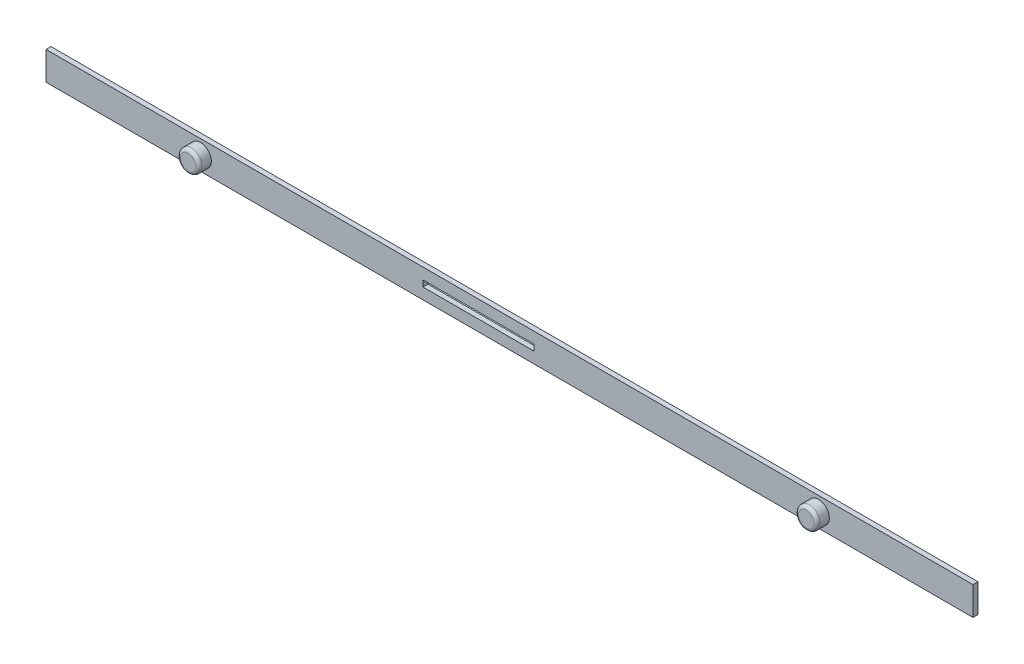
ISO-10303-21;
HEADER;
FILE_DESCRIPTION(('STEP AP214'),'2;1');
FILE_NAME('part.step','',(''),(''),'','','');
FILE_SCHEMA(('AUTOMOTIVE_DESIGN { 1 0 10303 214 1 1 1 1 }'));
ENDSEC;
DATA;
#1=APPLICATION_CONTEXT('core data for automotive mechanical design processes');
#2=APPLICATION_PROTOCOL_DEFINITION('international standard','automotive_design',2000,#1);
#3=PRODUCT_CONTEXT('',#1,'mechanical');
#4=PRODUCT('Part','Part','',(#3));
#5=PRODUCT_RELATED_PRODUCT_CATEGORY('part','',(#4));
#6=PRODUCT_DEFINITION_FORMATION('','',#4);
#7=PRODUCT_DEFINITION_CONTEXT('part definition',#1,'design');
#8=PRODUCT_DEFINITION('design','',#6,#7);
#9=PRODUCT_DEFINITION_SHAPE('','',#8);
#10=(LENGTH_UNIT() NAMED_UNIT(*) SI_UNIT(.MILLI.,.METRE.));
#11=(NAMED_UNIT(*) PLANE_ANGLE_UNIT() SI_UNIT($,.RADIAN.));
#12=(NAMED_UNIT(*) SI_UNIT($,.STERADIAN.) SOLID_ANGLE_UNIT());
#13=UNCERTAINTY_MEASURE_WITH_UNIT(LENGTH_MEASURE(1.E-05),#10,'distance_accuracy_value','');
#14=(GEOMETRIC_REPRESENTATION_CONTEXT(3) GLOBAL_UNCERTAINTY_ASSIGNED_CONTEXT((#13)) GLOBAL_UNIT_ASSIGNED_CONTEXT((#10,
#11,#12)) REPRESENTATION_CONTEXT('',''));
#15=CARTESIAN_POINT('',(0.,0.,0.));
#16=DIRECTION('',(0.,0.,1.));
#17=DIRECTION('',(1.,0.,0.));
#18=AXIS2_PLACEMENT_3D('',#15,#16,#17);
#19=CARTESIAN_POINT('',(0.,0.,0.8));
#20=DIRECTION('',(0.,0.,1.));
#21=DIRECTION('',(1.,0.,0.));
#22=AXIS2_PLACEMENT_3D('',#19,#20,#21);
#23=PLANE('',#22);
#24=CARTESIAN_POINT('',(50.,0.,0.8));
#25=DIRECTION('',(0.,0.,1.));
#26=DIRECTION('',(1.,0.,0.));
#27=AXIS2_PLACEMENT_3D('',#24,#25,#26);
#28=CIRCLE('',#27,1.75);
#29=CARTESIAN_POINT('',(51.75,0.,0.8));
#30=VERTEX_POINT('',#29);
#31=EDGE_CURVE('E328',#30,#30,#28,.T.);
#32=ORIENTED_EDGE('',*,*,#31,.F.);
#33=EDGE_LOOP('',(#32));
#34=FACE_BOUND('',#33,.T.);
#35=CARTESIAN_POINT('',(-50.,0.,0.8));
#36=DIRECTION('',(0.,0.,1.));
#37=DIRECTION('',(1.,0.,0.));
#38=AXIS2_PLACEMENT_3D('',#35,#36,#37);
#39=CIRCLE('',#38,1.75);
#40=CARTESIAN_POINT('',(-48.25,0.,0.8));
#41=VERTEX_POINT('',#40);
#42=EDGE_CURVE('E126',#41,#41,#39,.T.);
#43=ORIENTED_EDGE('',*,*,#42,.F.);
#44=EDGE_LOOP('',(#43));
#45=FACE_BOUND('',#44,.T.);
#46=DIRECTION('',(0.,1.,0.));
#47=VECTOR('',#46,1.);
#48=CARTESIAN_POINT('',(75.,2.3,0.8));
#49=LINE('',#48,#47);
#50=CARTESIAN_POINT('',(75.,-2.3,0.8));
#51=VERTEX_POINT('',#50);
#52=CARTESIAN_POINT('',(75.,2.3,0.8));
#53=VERTEX_POINT('',#52);
#54=EDGE_CURVE('E136',#51,#53,#49,.T.);
#55=ORIENTED_EDGE('',*,*,#54,.T.);
#56=DIRECTION('',(-1.,0.,0.));
#57=VECTOR('',#56,1.);
#58=CARTESIAN_POINT('',(-75.,2.3,0.8));
#59=LINE('',#58,#57);
#60=CARTESIAN_POINT('',(-75.,2.3,0.8));
#61=VERTEX_POINT('',#60);
#62=EDGE_CURVE('E139',#53,#61,#59,.T.);
#63=ORIENTED_EDGE('',*,*,#62,.T.);
#64=DIRECTION('',(0.,-1.,0.));
#65=VECTOR('',#64,1.);
#66=CARTESIAN_POINT('',(-75.,2.3,0.8));
#67=LINE('',#66,#65);
#68=CARTESIAN_POINT('',(-75.,-2.30000000000001,0.8));
#69=VERTEX_POINT('',#68);
#70=EDGE_CURVE('E142',#61,#69,#67,.T.);
#71=ORIENTED_EDGE('',*,*,#70,.T.);
#72=DIRECTION('',(1.,0.,0.));
#73=VECTOR('',#72,1.);
#74=CARTESIAN_POINT('',(-75.,-2.30000000000001,0.8));
#75=LINE('',#74,#73);
#76=EDGE_CURVE('E144',#69,#51,#75,.T.);
#77=ORIENTED_EDGE('',*,*,#76,.T.);
#78=EDGE_LOOP('',(#55,#63,#71,#77));
#79=FACE_BOUND('',#78,.T.);
#80=DIRECTION('',(1.,0.,0.));
#81=VECTOR('',#80,1.);
#82=CARTESIAN_POINT('',(4.,-0.499999999999995,0.8));
#83=LINE('',#82,#81);
#84=CARTESIAN_POINT('',(-14.,-0.499999999999997,0.8));
#85=VERTEX_POINT('',#84);
#86=CARTESIAN_POINT('',(4.,-0.499999999999995,0.8));
#87=VERTEX_POINT('',#86);
#88=EDGE_CURVE('E106',#85,#87,#83,.T.);
#89=ORIENTED_EDGE('',*,*,#88,.F.);
#90=DIRECTION('',(0.,-1.,0.));
#91=VECTOR('',#90,1.);
#92=CARTESIAN_POINT('',(-14.,0.500000000000003,0.8));
#93=LINE('',#92,#91);
#94=CARTESIAN_POINT('',(-14.,0.500000000000003,0.8));
#95=VERTEX_POINT('',#94);
#96=EDGE_CURVE('E98',#95,#85,#93,.T.);
#97=ORIENTED_EDGE('',*,*,#96,.F.);
#98=DIRECTION('',(-1.,0.,0.));
#99=VECTOR('',#98,1.);
#100=CARTESIAN_POINT('',(4.,0.500000000000005,0.8));
#101=LINE('',#100,#99);
#102=CARTESIAN_POINT('',(4.,0.500000000000005,0.8));
#103=VERTEX_POINT('',#102);
#104=EDGE_CURVE('E120',#103,#95,#101,.T.);
#105=ORIENTED_EDGE('',*,*,#104,.F.);
#106=DIRECTION('',(0.,1.,0.));
#107=VECTOR('',#106,1.);
#108=CARTESIAN_POINT('',(4.,0.500000000000005,0.8));
#109=LINE('',#108,#107);
#110=EDGE_CURVE('E118',#87,#103,#109,.T.);
#111=ORIENTED_EDGE('',*,*,#110,.F.);
#112=EDGE_LOOP('',(#89,#97,#105,#111));
#113=FACE_BOUND('',#112,.T.);
#114=ADVANCED_FACE('F33',(#34,#45,#79,#113),#23,.T.);
#115=CARTESIAN_POINT('',(0.,0.,0.));
#116=DIRECTION('',(0.,0.,1.));
#117=DIRECTION('',(1.,0.,0.));
#118=AXIS2_PLACEMENT_3D('',#115,#116,#117);
#119=PLANE('',#118);
#120=DIRECTION('',(0.,1.,0.));
#121=VECTOR('',#120,1.);
#122=CARTESIAN_POINT('',(75.,2.3,0.));
#123=LINE('',#122,#121);
#124=CARTESIAN_POINT('',(75.,-2.3,0.));
#125=VERTEX_POINT('',#124);
#126=CARTESIAN_POINT('',(75.,2.3,0.));
#127=VERTEX_POINT('',#126);
#128=EDGE_CURVE('E114',#125,#127,#123,.T.);
#129=ORIENTED_EDGE('',*,*,#128,.F.);
#130=DIRECTION('',(1.,0.,0.));
#131=VECTOR('',#130,1.);
#132=CARTESIAN_POINT('',(-75.,-2.30000000000001,0.));
#133=LINE('',#132,#131);
#134=CARTESIAN_POINT('',(-75.,-2.30000000000001,0.));
#135=VERTEX_POINT('',#134);
#136=EDGE_CURVE('E140',#135,#125,#133,.T.);
#137=ORIENTED_EDGE('',*,*,#136,.F.);
#138=DIRECTION('',(0.,-1.,0.));
#139=VECTOR('',#138,1.);
#140=CARTESIAN_POINT('',(-75.,2.3,0.));
#141=LINE('',#140,#139);
#142=CARTESIAN_POINT('',(-75.,2.3,0.));
#143=VERTEX_POINT('',#142);
#144=EDGE_CURVE('E151',#143,#135,#141,.T.);
#145=ORIENTED_EDGE('',*,*,#144,.F.);
#146=DIRECTION('',(-1.,0.,0.));
#147=VECTOR('',#146,1.);
#148=CARTESIAN_POINT('',(-75.,2.3,0.));
#149=LINE('',#148,#147);
#150=EDGE_CURVE('E149',#127,#143,#149,.T.);
#151=ORIENTED_EDGE('',*,*,#150,.F.);
#152=EDGE_LOOP('',(#129,#137,#145,#151));
#153=FACE_BOUND('',#152,.T.);
#154=DIRECTION('',(0.,-1.,0.));
#155=VECTOR('',#154,1.);
#156=CARTESIAN_POINT('',(-14.,0.500000000000003,0.));
#157=LINE('',#156,#155);
#158=CARTESIAN_POINT('',(-14.,0.500000000000003,0.));
#159=VERTEX_POINT('',#158);
#160=CARTESIAN_POINT('',(-14.,-0.499999999999997,0.));
#161=VERTEX_POINT('',#160);
#162=EDGE_CURVE('E56',#159,#161,#157,.T.);
#163=ORIENTED_EDGE('',*,*,#162,.T.);
#164=DIRECTION('',(1.,0.,0.));
#165=VECTOR('',#164,1.);
#166=CARTESIAN_POINT('',(4.,-0.499999999999995,0.));
#167=LINE('',#166,#165);
#168=CARTESIAN_POINT('',(4.,-0.499999999999995,0.));
#169=VERTEX_POINT('',#168);
#170=EDGE_CURVE('E113',#161,#169,#167,.T.);
#171=ORIENTED_EDGE('',*,*,#170,.T.);
#172=DIRECTION('',(0.,1.,0.));
#173=VECTOR('',#172,1.);
#174=CARTESIAN_POINT('',(4.,0.500000000000005,0.));
#175=LINE('',#174,#173);
#176=CARTESIAN_POINT('',(4.,0.500000000000005,0.));
#177=VERTEX_POINT('',#176);
#178=EDGE_CURVE('E128',#169,#177,#175,.T.);
#179=ORIENTED_EDGE('',*,*,#178,.T.);
#180=DIRECTION('',(-1.,0.,0.));
#181=VECTOR('',#180,1.);
#182=CARTESIAN_POINT('',(4.,0.500000000000005,0.));
#183=LINE('',#182,#181);
#184=EDGE_CURVE('E107',#177,#159,#183,.T.);
#185=ORIENTED_EDGE('',*,*,#184,.T.);
#186=EDGE_LOOP('',(#163,#171,#179,#185));
#187=FACE_BOUND('',#186,.T.);
#188=ADVANCED_FACE('F185',(#153,#187),#119,.F.);
#189=CARTESIAN_POINT('',(75.,2.3,0.8));
#190=DIRECTION('',(-1.,0.,0.));
#191=DIRECTION('',(0.,-1.,0.));
#192=AXIS2_PLACEMENT_3D('',#189,#190,#191);
#193=PLANE('',#192);
#194=ORIENTED_EDGE('',*,*,#128,.T.);
#195=DIRECTION('',(0.,0.,-1.));
#196=VECTOR('',#195,1.);
#197=CARTESIAN_POINT('',(75.,2.3,0.8));
#198=LINE('',#197,#196);
#199=EDGE_CURVE('E162',#53,#127,#198,.T.);
#200=ORIENTED_EDGE('',*,*,#199,.F.);
#201=ORIENTED_EDGE('',*,*,#54,.F.);
#202=DIRECTION('',(0.,0.,-1.));
#203=VECTOR('',#202,1.);
#204=CARTESIAN_POINT('',(75.,-2.3,0.8));
#205=LINE('',#204,#203);
#206=EDGE_CURVE('E146',#51,#125,#205,.T.);
#207=ORIENTED_EDGE('',*,*,#206,.T.);
#208=EDGE_LOOP('',(#194,#200,#201,#207));
#209=FACE_BOUND('',#208,.T.);
#210=ADVANCED_FACE('F191',(#209),#193,.F.);
#211=CARTESIAN_POINT('',(-75.,2.3,0.8));
#212=DIRECTION('',(0.,-1.,0.));
#213=DIRECTION('',(0.,0.,-1.));
#214=AXIS2_PLACEMENT_3D('',#211,#212,#213);
#215=PLANE('',#214);
#216=ORIENTED_EDGE('',*,*,#150,.T.);
#217=DIRECTION('',(0.,0.,-1.));
#218=VECTOR('',#217,1.);
#219=CARTESIAN_POINT('',(-75.,2.3,0.8));
#220=LINE('',#219,#218);
#221=EDGE_CURVE('E159',#61,#143,#220,.T.);
#222=ORIENTED_EDGE('',*,*,#221,.F.);
#223=ORIENTED_EDGE('',*,*,#62,.F.);
#224=ORIENTED_EDGE('',*,*,#199,.T.);
#225=EDGE_LOOP('',(#216,#222,#223,#224));
#226=FACE_BOUND('',#225,.T.);
#227=ADVANCED_FACE('F206',(#226),#215,.F.);
#228=CARTESIAN_POINT('',(-75.,2.3,0.8));
#229=DIRECTION('',(1.,0.,0.));
#230=DIRECTION('',(0.,1.,0.));
#231=AXIS2_PLACEMENT_3D('',#228,#229,#230);
#232=PLANE('',#231);
#233=ORIENTED_EDGE('',*,*,#144,.T.);
#234=DIRECTION('',(0.,0.,-1.));
#235=VECTOR('',#234,1.);
#236=CARTESIAN_POINT('',(-75.,-2.30000000000001,0.8));
#237=LINE('',#236,#235);
#238=EDGE_CURVE('E156',#69,#135,#237,.T.);
#239=ORIENTED_EDGE('',*,*,#238,.F.);
#240=ORIENTED_EDGE('',*,*,#70,.F.);
#241=ORIENTED_EDGE('',*,*,#221,.T.);
#242=EDGE_LOOP('',(#233,#239,#240,#241));
#243=FACE_BOUND('',#242,.T.);
#244=ADVANCED_FACE('F202',(#243),#232,.F.);
#245=CARTESIAN_POINT('',(-75.,-2.30000000000001,0.8));
#246=DIRECTION('',(0.,1.,0.));
#247=DIRECTION('',(-1.,0.,0.));
#248=AXIS2_PLACEMENT_3D('',#245,#246,#247);
#249=PLANE('',#248);
#250=ORIENTED_EDGE('',*,*,#136,.T.);
#251=ORIENTED_EDGE('',*,*,#206,.F.);
#252=ORIENTED_EDGE('',*,*,#76,.F.);
#253=ORIENTED_EDGE('',*,*,#238,.T.);
#254=EDGE_LOOP('',(#250,#251,#252,#253));
#255=FACE_BOUND('',#254,.T.);
#256=ADVANCED_FACE('F199',(#255),#249,.F.);
#257=CARTESIAN_POINT('',(-14.,0.500000000000003,0.8));
#258=DIRECTION('',(1.,0.,0.));
#259=DIRECTION('',(0.,0.,-1.));
#260=AXIS2_PLACEMENT_3D('',#257,#258,#259);
#261=PLANE('',#260);
#262=ORIENTED_EDGE('',*,*,#162,.F.);
#263=DIRECTION('',(0.,0.,-1.));
#264=VECTOR('',#263,1.);
#265=CARTESIAN_POINT('',(-14.,0.500000000000003,0.8));
#266=LINE('',#265,#264);
#267=EDGE_CURVE('E102',#95,#159,#266,.T.);
#268=ORIENTED_EDGE('',*,*,#267,.F.);
#269=ORIENTED_EDGE('',*,*,#96,.T.);
#270=DIRECTION('',(0.,0.,-1.));
#271=VECTOR('',#270,1.);
#272=CARTESIAN_POINT('',(-14.,-0.499999999999997,0.8));
#273=LINE('',#272,#271);
#274=EDGE_CURVE('E101',#85,#161,#273,.T.);
#275=ORIENTED_EDGE('',*,*,#274,.T.);
#276=EDGE_LOOP('',(#262,#268,#269,#275));
#277=FACE_BOUND('',#276,.T.);
#278=ADVANCED_FACE('F100',(#277),#261,.T.);
#279=CARTESIAN_POINT('',(4.,-0.499999999999995,0.8));
#280=DIRECTION('',(0.,1.,0.));
#281=DIRECTION('',(-1.,0.,0.));
#282=AXIS2_PLACEMENT_3D('',#279,#280,#281);
#283=PLANE('',#282);
#284=ORIENTED_EDGE('',*,*,#170,.F.);
#285=ORIENTED_EDGE('',*,*,#274,.F.);
#286=ORIENTED_EDGE('',*,*,#88,.T.);
#287=DIRECTION('',(0.,0.,-1.));
#288=VECTOR('',#287,1.);
#289=CARTESIAN_POINT('',(4.,-0.499999999999995,0.8));
#290=LINE('',#289,#288);
#291=EDGE_CURVE('E115',#87,#169,#290,.T.);
#292=ORIENTED_EDGE('',*,*,#291,.T.);
#293=EDGE_LOOP('',(#284,#285,#286,#292));
#294=FACE_BOUND('',#293,.T.);
#295=ADVANCED_FACE('F110',(#294),#283,.T.);
#296=CARTESIAN_POINT('',(4.,0.500000000000005,0.8));
#297=DIRECTION('',(-1.,0.,0.));
#298=DIRECTION('',(0.,0.,1.));
#299=AXIS2_PLACEMENT_3D('',#296,#297,#298);
#300=PLANE('',#299);
#301=ORIENTED_EDGE('',*,*,#178,.F.);
#302=ORIENTED_EDGE('',*,*,#291,.F.);
#303=ORIENTED_EDGE('',*,*,#110,.T.);
#304=DIRECTION('',(0.,0.,-1.));
#305=VECTOR('',#304,1.);
#306=CARTESIAN_POINT('',(4.,0.500000000000005,0.8));
#307=LINE('',#306,#305);
#308=EDGE_CURVE('E48',#103,#177,#307,.T.);
#309=ORIENTED_EDGE('',*,*,#308,.T.);
#310=EDGE_LOOP('',(#301,#302,#303,#309));
#311=FACE_BOUND('',#310,.T.);
#312=ADVANCED_FACE('F231',(#311),#300,.T.);
#313=CARTESIAN_POINT('',(4.,0.500000000000005,0.8));
#314=DIRECTION('',(0.,-1.,0.));
#315=DIRECTION('',(1.,0.,0.));
#316=AXIS2_PLACEMENT_3D('',#313,#314,#315);
#317=PLANE('',#316);
#318=ORIENTED_EDGE('',*,*,#184,.F.);
#319=ORIENTED_EDGE('',*,*,#308,.F.);
#320=ORIENTED_EDGE('',*,*,#104,.T.);
#321=ORIENTED_EDGE('',*,*,#267,.T.);
#322=EDGE_LOOP('',(#318,#319,#320,#321));
#323=FACE_BOUND('',#322,.T.);
#324=ADVANCED_FACE('F228',(#323),#317,.T.);
#325=CARTESIAN_POINT('',(-50.,0.,2.8));
#326=DIRECTION('',(0.,0.,-1.));
#327=DIRECTION('',(-1.,0.,0.));
#328=AXIS2_PLACEMENT_3D('',#325,#326,#327);
#329=CYLINDRICAL_SURFACE('',#328,1.75);
#330=CARTESIAN_POINT('',(-50.,0.,2.3));
#331=DIRECTION('',(0.,0.,1.));
#332=DIRECTION('',(1.,0.,0.));
#333=AXIS2_PLACEMENT_3D('',#330,#331,#332);
#334=CIRCLE('',#333,1.75);
#335=CARTESIAN_POINT('',(-48.25,0.,2.3));
#336=VERTEX_POINT('',#335);
#337=EDGE_CURVE('E11',#336,#336,#334,.F.);
#338=ORIENTED_EDGE('',*,*,#337,.T.);
#339=EDGE_LOOP('',(#338));
#340=FACE_BOUND('',#339,.T.);
#341=ORIENTED_EDGE('',*,*,#42,.T.);
#342=EDGE_LOOP('',(#341));
#343=FACE_BOUND('',#342,.T.);
#344=ADVANCED_FACE('F230',(#340,#343),#329,.T.);
#345=CARTESIAN_POINT('',(-50.,0.,2.8));
#346=DIRECTION('',(0.,0.,1.));
#347=DIRECTION('',(1.,0.,0.));
#348=AXIS2_PLACEMENT_3D('',#345,#346,#347);
#349=PLANE('',#348);
#350=CARTESIAN_POINT('',(-50.,0.,2.8));
#351=DIRECTION('',(0.,0.,1.));
#352=DIRECTION('',(1.,0.,0.));
#353=AXIS2_PLACEMENT_3D('',#350,#351,#352);
#354=CIRCLE('',#353,1.25);
#355=CARTESIAN_POINT('',(-48.75,0.,2.8));
#356=VERTEX_POINT('',#355);
#357=EDGE_CURVE('E41',#356,#356,#354,.T.);
#358=ORIENTED_EDGE('',*,*,#357,.T.);
#359=EDGE_LOOP('',(#358));
#360=FACE_BOUND('',#359,.T.);
#361=ADVANCED_FACE('F173',(#360),#349,.T.);
#362=CARTESIAN_POINT('',(50.,0.,2.8));
#363=DIRECTION('',(0.,0.,-1.));
#364=DIRECTION('',(-1.,0.,0.));
#365=AXIS2_PLACEMENT_3D('',#362,#363,#364);
#366=CYLINDRICAL_SURFACE('',#365,1.75);
#367=CARTESIAN_POINT('',(50.,0.,2.3));
#368=DIRECTION('',(0.,0.,1.));
#369=DIRECTION('',(1.,0.,0.));
#370=AXIS2_PLACEMENT_3D('',#367,#368,#369);
#371=CIRCLE('',#370,1.75);
#372=CARTESIAN_POINT('',(51.75,0.,2.3));
#373=VERTEX_POINT('',#372);
#374=EDGE_CURVE('E168',#373,#373,#371,.F.);
#375=ORIENTED_EDGE('',*,*,#374,.T.);
#376=EDGE_LOOP('',(#375));
#377=FACE_BOUND('',#376,.T.);
#378=ORIENTED_EDGE('',*,*,#31,.T.);
#379=EDGE_LOOP('',(#378));
#380=FACE_BOUND('',#379,.T.);
#381=ADVANCED_FACE('F292',(#377,#380),#366,.T.);
#382=CARTESIAN_POINT('',(50.,0.,2.8));
#383=DIRECTION('',(0.,0.,1.));
#384=DIRECTION('',(1.,0.,0.));
#385=AXIS2_PLACEMENT_3D('',#382,#383,#384);
#386=PLANE('',#385);
#387=CARTESIAN_POINT('',(50.,0.,2.8));
#388=DIRECTION('',(0.,0.,1.));
#389=DIRECTION('',(1.,0.,0.));
#390=AXIS2_PLACEMENT_3D('',#387,#388,#389);
#391=CIRCLE('',#390,1.25);
#392=CARTESIAN_POINT('',(51.25,0.,2.8));
#393=VERTEX_POINT('',#392);
#394=EDGE_CURVE('E165',#393,#393,#391,.T.);
#395=ORIENTED_EDGE('',*,*,#394,.T.);
#396=EDGE_LOOP('',(#395));
#397=FACE_BOUND('',#396,.T.);
#398=ADVANCED_FACE('F181',(#397),#386,.T.);
#399=CARTESIAN_POINT('',(50.,0.,2.3));
#400=DIRECTION('',(0.,0.,1.));
#401=DIRECTION('',(1.,0.,0.));
#402=AXIS2_PLACEMENT_3D('',#399,#400,#401);
#403=TOROIDAL_SURFACE('',#402,1.25,0.5);
#404=ORIENTED_EDGE('',*,*,#374,.F.);
#405=EDGE_LOOP('',(#404));
#406=FACE_BOUND('',#405,.T.);
#407=ORIENTED_EDGE('',*,*,#394,.F.);
#408=EDGE_LOOP('',(#407));
#409=FACE_BOUND('',#408,.T.);
#410=ADVANCED_FACE('F176',(#406,#409),#403,.T.);
#411=CARTESIAN_POINT('',(-50.,0.,2.3));
#412=DIRECTION('',(0.,0.,1.));
#413=DIRECTION('',(1.,0.,0.));
#414=AXIS2_PLACEMENT_3D('',#411,#412,#413);
#415=TOROIDAL_SURFACE('',#414,1.25,0.5);
#416=ORIENTED_EDGE('',*,*,#337,.F.);
#417=EDGE_LOOP('',(#416));
#418=FACE_BOUND('',#417,.T.);
#419=ORIENTED_EDGE('',*,*,#357,.F.);
#420=EDGE_LOOP('',(#419));
#421=FACE_BOUND('',#420,.T.);
#422=ADVANCED_FACE('F35',(#418,#421),#415,.T.);
#423=CLOSED_SHELL('',(#114,#188,#210,#227,#244,#256,#278,#295,#312,#324,#344,#361,#381,#398,
#410,#422));
#424=MANIFOLD_SOLID_BREP('B2',#423);
#425=ADVANCED_BREP_SHAPE_REPRESENTATION('',(#18,#424),#14);
#426=SHAPE_DEFINITION_REPRESENTATION(#9,#425);
ENDSEC;
END-ISO-10303-21;
